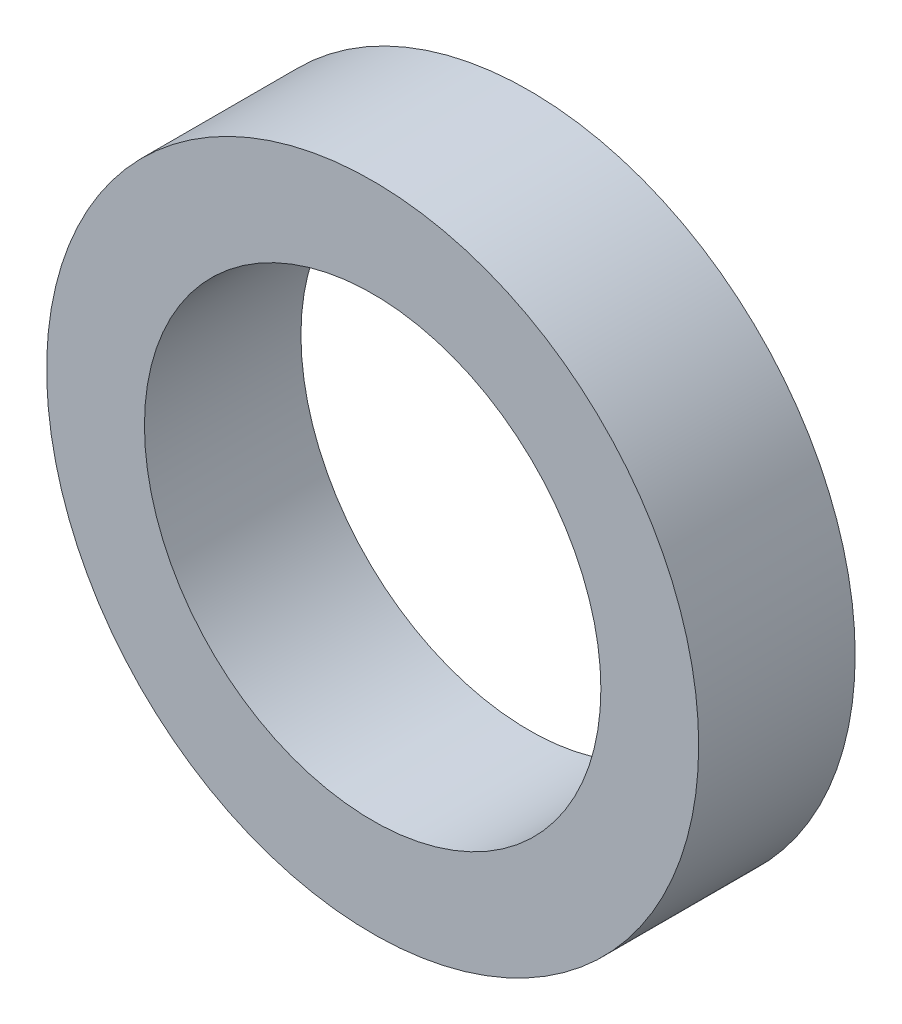
ISO-10303-21;
HEADER;
FILE_DESCRIPTION(('STEP AP214'),'2;1');
FILE_NAME('part.step','',(''),(''),'','','');
FILE_SCHEMA(('AUTOMOTIVE_DESIGN { 1 0 10303 214 1 1 1 1 }'));
ENDSEC;
DATA;
#1=APPLICATION_CONTEXT('core data for automotive mechanical design processes');
#2=APPLICATION_PROTOCOL_DEFINITION('international standard','automotive_design',2000,#1);
#3=PRODUCT_CONTEXT('',#1,'mechanical');
#4=PRODUCT('Part','Part','',(#3));
#5=PRODUCT_RELATED_PRODUCT_CATEGORY('part','',(#4));
#6=PRODUCT_DEFINITION_FORMATION('','',#4);
#7=PRODUCT_DEFINITION_CONTEXT('part definition',#1,'design');
#8=PRODUCT_DEFINITION('design','',#6,#7);
#9=PRODUCT_DEFINITION_SHAPE('','',#8);
#10=(LENGTH_UNIT() NAMED_UNIT(*) SI_UNIT(.MILLI.,.METRE.));
#11=(NAMED_UNIT(*) PLANE_ANGLE_UNIT() SI_UNIT($,.RADIAN.));
#12=(NAMED_UNIT(*) SI_UNIT($,.STERADIAN.) SOLID_ANGLE_UNIT());
#13=UNCERTAINTY_MEASURE_WITH_UNIT(LENGTH_MEASURE(1.E-05),#10,'distance_accuracy_value','');
#14=(GEOMETRIC_REPRESENTATION_CONTEXT(3) GLOBAL_UNCERTAINTY_ASSIGNED_CONTEXT((#13)) GLOBAL_UNIT_ASSIGNED_CONTEXT((#10,
#11,#12)) REPRESENTATION_CONTEXT('',''));
#15=CARTESIAN_POINT('',(0.,0.,0.));
#16=DIRECTION('',(0.,0.,1.));
#17=DIRECTION('',(1.,0.,0.));
#18=AXIS2_PLACEMENT_3D('',#15,#16,#17);
#19=CARTESIAN_POINT('',(0.,0.,-6.));
#20=DIRECTION('',(0.,0.,1.));
#21=DIRECTION('',(1.,0.,0.));
#22=AXIS2_PLACEMENT_3D('',#19,#20,#21);
#23=CYLINDRICAL_SURFACE('',#22,12.5);
#24=CARTESIAN_POINT('',(0.,0.,-6.));
#25=DIRECTION('',(0.,0.,1.));
#26=DIRECTION('',(1.,0.,0.));
#27=AXIS2_PLACEMENT_3D('',#24,#25,#26);
#28=CIRCLE('',#27,12.5);
#29=CARTESIAN_POINT('',(12.5,0.,-6.));
#30=VERTEX_POINT('',#29);
#31=EDGE_CURVE('E10',#30,#30,#28,.T.);
#32=ORIENTED_EDGE('',*,*,#31,.T.);
#33=EDGE_LOOP('',(#32));
#34=FACE_BOUND('',#33,.T.);
#35=CARTESIAN_POINT('',(0.,0.,0.));
#36=DIRECTION('',(0.,0.,1.));
#37=DIRECTION('',(1.,0.,0.));
#38=AXIS2_PLACEMENT_3D('',#35,#36,#37);
#39=CIRCLE('',#38,12.5);
#40=CARTESIAN_POINT('',(12.5,0.,0.));
#41=VERTEX_POINT('',#40);
#42=EDGE_CURVE('E37',#41,#41,#39,.T.);
#43=ORIENTED_EDGE('',*,*,#42,.F.);
#44=EDGE_LOOP('',(#43));
#45=FACE_BOUND('',#44,.T.);
#46=ADVANCED_FACE('F34',(#34,#45),#23,.T.);
#47=CARTESIAN_POINT('',(0.,0.,-6.));
#48=DIRECTION('',(0.,0.,1.));
#49=DIRECTION('',(1.,0.,0.));
#50=AXIS2_PLACEMENT_3D('',#47,#48,#49);
#51=PLANE('',#50);
#52=CARTESIAN_POINT('',(0.,0.,-6.));
#53=DIRECTION('',(0.,0.,1.));
#54=DIRECTION('',(1.,0.,0.));
#55=AXIS2_PLACEMENT_3D('',#52,#53,#54);
#56=CIRCLE('',#55,8.75);
#57=CARTESIAN_POINT('',(8.75,0.,-6.));
#58=VERTEX_POINT('',#57);
#59=EDGE_CURVE('E47',#58,#58,#56,.T.);
#60=ORIENTED_EDGE('',*,*,#59,.T.);
#61=EDGE_LOOP('',(#60));
#62=FACE_BOUND('',#61,.T.);
#63=ORIENTED_EDGE('',*,*,#31,.F.);
#64=EDGE_LOOP('',(#63));
#65=FACE_BOUND('',#64,.T.);
#66=ADVANCED_FACE('F55',(#62,#65),#51,.F.);
#67=CARTESIAN_POINT('',(0.,0.,0.));
#68=DIRECTION('',(0.,0.,1.));
#69=DIRECTION('',(1.,0.,0.));
#70=AXIS2_PLACEMENT_3D('',#67,#68,#69);
#71=PLANE('',#70);
#72=CARTESIAN_POINT('',(0.,0.,0.));
#73=DIRECTION('',(0.,0.,1.));
#74=DIRECTION('',(1.,0.,0.));
#75=AXIS2_PLACEMENT_3D('',#72,#73,#74);
#76=CIRCLE('',#75,8.75);
#77=CARTESIAN_POINT('',(8.75,0.,0.));
#78=VERTEX_POINT('',#77);
#79=EDGE_CURVE('E49',#78,#78,#76,.T.);
#80=ORIENTED_EDGE('',*,*,#79,.F.);
#81=EDGE_LOOP('',(#80));
#82=FACE_BOUND('',#81,.T.);
#83=ORIENTED_EDGE('',*,*,#42,.T.);
#84=EDGE_LOOP('',(#83));
#85=FACE_BOUND('',#84,.T.);
#86=ADVANCED_FACE('F61',(#82,#85),#71,.T.);
#87=CARTESIAN_POINT('',(0.,0.,-6.));
#88=DIRECTION('',(0.,0.,1.));
#89=DIRECTION('',(1.,0.,0.));
#90=AXIS2_PLACEMENT_3D('',#87,#88,#89);
#91=CYLINDRICAL_SURFACE('',#90,8.75);
#92=ORIENTED_EDGE('',*,*,#59,.F.);
#93=EDGE_LOOP('',(#92));
#94=FACE_BOUND('',#93,.T.);
#95=ORIENTED_EDGE('',*,*,#79,.T.);
#96=EDGE_LOOP('',(#95));
#97=FACE_BOUND('',#96,.T.);
#98=ADVANCED_FACE('F58',(#94,#97),#91,.F.);
#99=CLOSED_SHELL('',(#46,#66,#86,#98));
#100=MANIFOLD_SOLID_BREP('B2',#99);
#101=ADVANCED_BREP_SHAPE_REPRESENTATION('',(#18,#100),#14);
#102=SHAPE_DEFINITION_REPRESENTATION(#9,#101);
ENDSEC;
END-ISO-10303-21;
